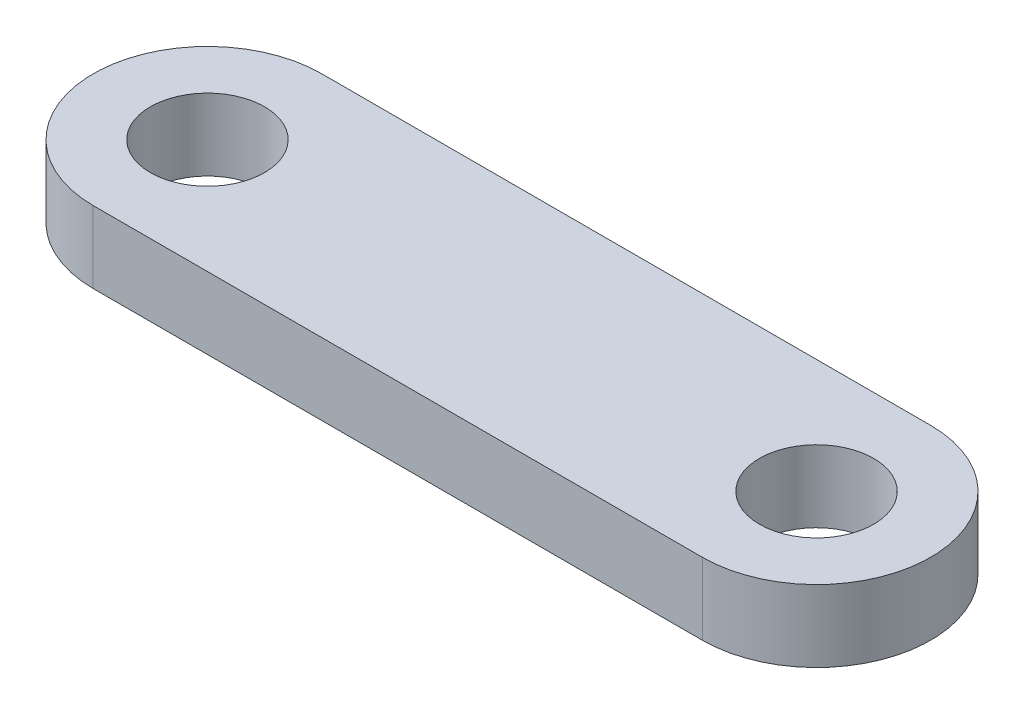
ISO-10303-21;
HEADER;
FILE_DESCRIPTION(('STEP AP214'),'2;1');
FILE_NAME('part.step','',(''),(''),'','','');
FILE_SCHEMA(('AUTOMOTIVE_DESIGN { 1 0 10303 214 1 1 1 1 }'));
ENDSEC;
DATA;
#1=APPLICATION_CONTEXT('core data for automotive mechanical design processes');
#2=APPLICATION_PROTOCOL_DEFINITION('international standard','automotive_design',2000,#1);
#3=PRODUCT_CONTEXT('',#1,'mechanical');
#4=PRODUCT('Part','Part','',(#3));
#5=PRODUCT_RELATED_PRODUCT_CATEGORY('part','',(#4));
#6=PRODUCT_DEFINITION_FORMATION('','',#4);
#7=PRODUCT_DEFINITION_CONTEXT('part definition',#1,'design');
#8=PRODUCT_DEFINITION('design','',#6,#7);
#9=PRODUCT_DEFINITION_SHAPE('','',#8);
#10=(LENGTH_UNIT() NAMED_UNIT(*) SI_UNIT(.MILLI.,.METRE.));
#11=(NAMED_UNIT(*) PLANE_ANGLE_UNIT() SI_UNIT($,.RADIAN.));
#12=(NAMED_UNIT(*) SI_UNIT($,.STERADIAN.) SOLID_ANGLE_UNIT());
#13=UNCERTAINTY_MEASURE_WITH_UNIT(LENGTH_MEASURE(1.E-05),#10,'distance_accuracy_value','');
#14=(GEOMETRIC_REPRESENTATION_CONTEXT(3) GLOBAL_UNCERTAINTY_ASSIGNED_CONTEXT((#13)) GLOBAL_UNIT_ASSIGNED_CONTEXT((#10,
#11,#12)) REPRESENTATION_CONTEXT('',''));
#15=CARTESIAN_POINT('',(0.,0.,0.));
#16=DIRECTION('',(0.,0.,1.));
#17=DIRECTION('',(1.,0.,0.));
#18=AXIS2_PLACEMENT_3D('',#15,#16,#17);
#19=CARTESIAN_POINT('',(-12.7,1.4986,0.));
#20=DIRECTION('',(0.,1.,0.));
#21=DIRECTION('',(0.,0.,1.));
#22=AXIS2_PLACEMENT_3D('',#19,#20,#21);
#23=PLANE('',#22);
#24=CARTESIAN_POINT('',(-12.7,1.4986,0.));
#25=DIRECTION('',(0.,1.,0.));
#26=DIRECTION('',(0.,0.,1.));
#27=AXIS2_PLACEMENT_3D('',#24,#25,#26);
#28=CIRCLE('',#27,2.38125);
#29=CARTESIAN_POINT('',(-12.7,1.4986,2.38125));
#30=VERTEX_POINT('',#29);
#31=EDGE_CURVE('E98',#30,#30,#28,.T.);
#32=ORIENTED_EDGE('',*,*,#31,.F.);
#33=EDGE_LOOP('',(#32));
#34=FACE_BOUND('',#33,.T.);
#35=CARTESIAN_POINT('',(-12.7,1.4986,0.));
#36=DIRECTION('',(0.,1.,0.));
#37=DIRECTION('',(0.,0.,1.));
#38=AXIS2_PLACEMENT_3D('',#35,#36,#37);
#39=CIRCLE('',#38,4.7625);
#40=CARTESIAN_POINT('',(-12.7,1.4986,-4.7625));
#41=VERTEX_POINT('',#40);
#42=CARTESIAN_POINT('',(-12.7,1.4986,4.7625));
#43=VERTEX_POINT('',#42);
#44=EDGE_CURVE('E83',#41,#43,#39,.T.);
#45=ORIENTED_EDGE('',*,*,#44,.T.);
#46=DIRECTION('',(1.,0.,0.));
#47=VECTOR('',#46,1.);
#48=CARTESIAN_POINT('',(-12.7,1.4986,4.7625));
#49=LINE('',#48,#47);
#50=CARTESIAN_POINT('',(12.7,1.4986,4.76249999999999));
#51=VERTEX_POINT('',#50);
#52=EDGE_CURVE('E78',#43,#51,#49,.T.);
#53=ORIENTED_EDGE('',*,*,#52,.T.);
#54=CARTESIAN_POINT('',(12.7,1.4986,0.));
#55=DIRECTION('',(0.,1.,0.));
#56=DIRECTION('',(0.,0.,1.));
#57=AXIS2_PLACEMENT_3D('',#54,#55,#56);
#58=CIRCLE('',#57,4.7625);
#59=CARTESIAN_POINT('',(12.7,1.4986,-4.7625));
#60=VERTEX_POINT('',#59);
#61=EDGE_CURVE('E81',#51,#60,#58,.T.);
#62=ORIENTED_EDGE('',*,*,#61,.T.);
#63=DIRECTION('',(-1.,0.,0.));
#64=VECTOR('',#63,1.);
#65=CARTESIAN_POINT('',(-12.7,1.4986,-4.7625));
#66=LINE('',#65,#64);
#67=EDGE_CURVE('E48',#60,#41,#66,.T.);
#68=ORIENTED_EDGE('',*,*,#67,.T.);
#69=EDGE_LOOP('',(#45,#53,#62,#68));
#70=FACE_BOUND('',#69,.T.);
#71=CARTESIAN_POINT('',(12.7,1.4986,0.));
#72=DIRECTION('',(0.,1.,0.));
#73=DIRECTION('',(0.,0.,1.));
#74=AXIS2_PLACEMENT_3D('',#71,#72,#73);
#75=CIRCLE('',#74,2.38125);
#76=CARTESIAN_POINT('',(12.7,1.4986,2.38125));
#77=VERTEX_POINT('',#76);
#78=EDGE_CURVE('E113',#77,#77,#75,.T.);
#79=ORIENTED_EDGE('',*,*,#78,.F.);
#80=EDGE_LOOP('',(#79));
#81=FACE_BOUND('',#80,.T.);
#82=ADVANCED_FACE('F31',(#34,#70,#81),#23,.T.);
#83=CARTESIAN_POINT('',(-12.7,-1.4986,0.));
#84=DIRECTION('',(0.,1.,0.));
#85=DIRECTION('',(0.,0.,1.));
#86=AXIS2_PLACEMENT_3D('',#83,#84,#85);
#87=PLANE('',#86);
#88=CARTESIAN_POINT('',(-12.7,-1.4986,0.));
#89=DIRECTION('',(0.,1.,0.));
#90=DIRECTION('',(0.,0.,1.));
#91=AXIS2_PLACEMENT_3D('',#88,#89,#90);
#92=CIRCLE('',#91,2.38125);
#93=CARTESIAN_POINT('',(-12.7,-1.4986,2.38125));
#94=VERTEX_POINT('',#93);
#95=EDGE_CURVE('E110',#94,#94,#92,.T.);
#96=ORIENTED_EDGE('',*,*,#95,.T.);
#97=EDGE_LOOP('',(#96));
#98=FACE_BOUND('',#97,.T.);
#99=CARTESIAN_POINT('',(-12.7,-1.4986,0.));
#100=DIRECTION('',(0.,1.,0.));
#101=DIRECTION('',(0.,0.,1.));
#102=AXIS2_PLACEMENT_3D('',#99,#100,#101);
#103=CIRCLE('',#102,4.7625);
#104=CARTESIAN_POINT('',(-12.7,-1.4986,-4.7625));
#105=VERTEX_POINT('',#104);
#106=CARTESIAN_POINT('',(-12.7,-1.4986,4.7625));
#107=VERTEX_POINT('',#106);
#108=EDGE_CURVE('E95',#105,#107,#103,.T.);
#109=ORIENTED_EDGE('',*,*,#108,.F.);
#110=DIRECTION('',(-1.,0.,0.));
#111=VECTOR('',#110,1.);
#112=CARTESIAN_POINT('',(-12.7,-1.4986,-4.7625));
#113=LINE('',#112,#111);
#114=CARTESIAN_POINT('',(12.7,-1.4986,-4.7625));
#115=VERTEX_POINT('',#114);
#116=EDGE_CURVE('E71',#115,#105,#113,.T.);
#117=ORIENTED_EDGE('',*,*,#116,.F.);
#118=CARTESIAN_POINT('',(12.7,-1.4986,0.));
#119=DIRECTION('',(0.,1.,0.));
#120=DIRECTION('',(0.,0.,1.));
#121=AXIS2_PLACEMENT_3D('',#118,#119,#120);
#122=CIRCLE('',#121,4.7625);
#123=CARTESIAN_POINT('',(12.7,-1.4986,4.76249999999999));
#124=VERTEX_POINT('',#123);
#125=EDGE_CURVE('E65',#124,#115,#122,.T.);
#126=ORIENTED_EDGE('',*,*,#125,.F.);
#127=DIRECTION('',(1.,0.,0.));
#128=VECTOR('',#127,1.);
#129=CARTESIAN_POINT('',(-12.7,-1.4986,4.7625));
#130=LINE('',#129,#128);
#131=EDGE_CURVE('E87',#107,#124,#130,.T.);
#132=ORIENTED_EDGE('',*,*,#131,.F.);
#133=EDGE_LOOP('',(#109,#117,#126,#132));
#134=FACE_BOUND('',#133,.T.);
#135=CARTESIAN_POINT('',(12.7,-1.4986,0.));
#136=DIRECTION('',(0.,1.,0.));
#137=DIRECTION('',(0.,0.,1.));
#138=AXIS2_PLACEMENT_3D('',#135,#136,#137);
#139=CIRCLE('',#138,2.38125);
#140=CARTESIAN_POINT('',(12.7,-1.4986,2.38125));
#141=VERTEX_POINT('',#140);
#142=EDGE_CURVE('E116',#141,#141,#139,.T.);
#143=ORIENTED_EDGE('',*,*,#142,.T.);
#144=EDGE_LOOP('',(#143));
#145=FACE_BOUND('',#144,.T.);
#146=ADVANCED_FACE('F106',(#98,#134,#145),#87,.F.);
#147=CARTESIAN_POINT('',(-12.7,1.4986,0.));
#148=DIRECTION('',(0.,-1.,0.));
#149=DIRECTION('',(0.,0.,-1.));
#150=AXIS2_PLACEMENT_3D('',#147,#148,#149);
#151=CYLINDRICAL_SURFACE('',#150,4.7625);
#152=ORIENTED_EDGE('',*,*,#108,.T.);
#153=DIRECTION('',(0.,-1.,0.));
#154=VECTOR('',#153,1.);
#155=CARTESIAN_POINT('',(-12.7,1.4986,4.7625));
#156=LINE('',#155,#154);
#157=EDGE_CURVE('E11',#43,#107,#156,.T.);
#158=ORIENTED_EDGE('',*,*,#157,.F.);
#159=ORIENTED_EDGE('',*,*,#44,.F.);
#160=DIRECTION('',(0.,-1.,0.));
#161=VECTOR('',#160,1.);
#162=CARTESIAN_POINT('',(-12.7,1.4986,-4.7625));
#163=LINE('',#162,#161);
#164=EDGE_CURVE('E91',#41,#105,#163,.T.);
#165=ORIENTED_EDGE('',*,*,#164,.T.);
#166=EDGE_LOOP('',(#152,#158,#159,#165));
#167=FACE_BOUND('',#166,.T.);
#168=ADVANCED_FACE('F33',(#167),#151,.T.);
#169=CARTESIAN_POINT('',(-12.7,1.4986,4.7625));
#170=DIRECTION('',(0.,0.,-1.));
#171=DIRECTION('',(-1.,0.,0.));
#172=AXIS2_PLACEMENT_3D('',#169,#170,#171);
#173=PLANE('',#172);
#174=ORIENTED_EDGE('',*,*,#131,.T.);
#175=DIRECTION('',(0.,-1.,0.));
#176=VECTOR('',#175,1.);
#177=CARTESIAN_POINT('',(12.7,1.4986,4.76249999999999));
#178=LINE('',#177,#176);
#179=EDGE_CURVE('E40',#51,#124,#178,.T.);
#180=ORIENTED_EDGE('',*,*,#179,.F.);
#181=ORIENTED_EDGE('',*,*,#52,.F.);
#182=ORIENTED_EDGE('',*,*,#157,.T.);
#183=EDGE_LOOP('',(#174,#180,#181,#182));
#184=FACE_BOUND('',#183,.T.);
#185=ADVANCED_FACE('F86',(#184),#173,.F.);
#186=CARTESIAN_POINT('',(12.7,1.4986,0.));
#187=DIRECTION('',(0.,-1.,0.));
#188=DIRECTION('',(0.,0.,-1.));
#189=AXIS2_PLACEMENT_3D('',#186,#187,#188);
#190=CYLINDRICAL_SURFACE('',#189,4.7625);
#191=ORIENTED_EDGE('',*,*,#125,.T.);
#192=DIRECTION('',(0.,-1.,0.));
#193=VECTOR('',#192,1.);
#194=CARTESIAN_POINT('',(12.7,1.4986,-4.7625));
#195=LINE('',#194,#193);
#196=EDGE_CURVE('E88',#60,#115,#195,.T.);
#197=ORIENTED_EDGE('',*,*,#196,.F.);
#198=ORIENTED_EDGE('',*,*,#61,.F.);
#199=ORIENTED_EDGE('',*,*,#179,.T.);
#200=EDGE_LOOP('',(#191,#197,#198,#199));
#201=FACE_BOUND('',#200,.T.);
#202=ADVANCED_FACE('F89',(#201),#190,.T.);
#203=CARTESIAN_POINT('',(-12.7,1.4986,-4.7625));
#204=DIRECTION('',(0.,0.,1.));
#205=DIRECTION('',(1.,0.,0.));
#206=AXIS2_PLACEMENT_3D('',#203,#204,#205);
#207=PLANE('',#206);
#208=ORIENTED_EDGE('',*,*,#116,.T.);
#209=ORIENTED_EDGE('',*,*,#164,.F.);
#210=ORIENTED_EDGE('',*,*,#67,.F.);
#211=ORIENTED_EDGE('',*,*,#196,.T.);
#212=EDGE_LOOP('',(#208,#209,#210,#211));
#213=FACE_BOUND('',#212,.T.);
#214=ADVANCED_FACE('F103',(#213),#207,.F.);
#215=CARTESIAN_POINT('',(-12.7,1.4986,0.));
#216=DIRECTION('',(0.,-1.,0.));
#217=DIRECTION('',(0.,0.,-1.));
#218=AXIS2_PLACEMENT_3D('',#215,#216,#217);
#219=CYLINDRICAL_SURFACE('',#218,2.38125);
#220=ORIENTED_EDGE('',*,*,#31,.T.);
#221=EDGE_LOOP('',(#220));
#222=FACE_BOUND('',#221,.T.);
#223=ORIENTED_EDGE('',*,*,#95,.F.);
#224=EDGE_LOOP('',(#223));
#225=FACE_BOUND('',#224,.T.);
#226=ADVANCED_FACE('F134',(#222,#225),#219,.F.);
#227=CARTESIAN_POINT('',(12.7,1.4986,0.));
#228=DIRECTION('',(0.,-1.,0.));
#229=DIRECTION('',(0.,0.,-1.));
#230=AXIS2_PLACEMENT_3D('',#227,#228,#229);
#231=CYLINDRICAL_SURFACE('',#230,2.38125);
#232=ORIENTED_EDGE('',*,*,#78,.T.);
#233=EDGE_LOOP('',(#232));
#234=FACE_BOUND('',#233,.T.);
#235=ORIENTED_EDGE('',*,*,#142,.F.);
#236=EDGE_LOOP('',(#235));
#237=FACE_BOUND('',#236,.T.);
#238=ADVANCED_FACE('F122',(#234,#237),#231,.F.);
#239=CLOSED_SHELL('',(#82,#146,#168,#185,#202,#214,#226,#238));
#240=MANIFOLD_SOLID_BREP('B2',#239);
#241=ADVANCED_BREP_SHAPE_REPRESENTATION('',(#18,#240),#14);
#242=SHAPE_DEFINITION_REPRESENTATION(#9,#241);
ENDSEC;
END-ISO-10303-21;
